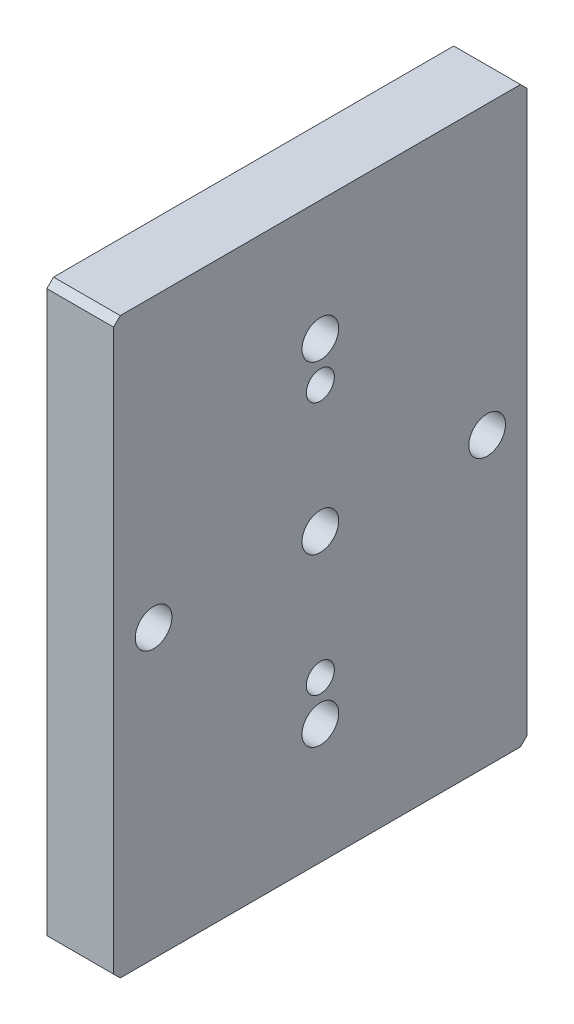
ISO-10303-21;
HEADER;
FILE_DESCRIPTION(('STEP AP214'),'2;1');
FILE_NAME('part.step','',(''),(''),'','','');
FILE_SCHEMA(('AUTOMOTIVE_DESIGN { 1 0 10303 214 1 1 1 1 }'));
ENDSEC;
DATA;
#1=APPLICATION_CONTEXT('core data for automotive mechanical design processes');
#2=APPLICATION_PROTOCOL_DEFINITION('international standard','automotive_design',2000,#1);
#3=PRODUCT_CONTEXT('',#1,'mechanical');
#4=PRODUCT('Part','Part','',(#3));
#5=PRODUCT_RELATED_PRODUCT_CATEGORY('part','',(#4));
#6=PRODUCT_DEFINITION_FORMATION('','',#4);
#7=PRODUCT_DEFINITION_CONTEXT('part definition',#1,'design');
#8=PRODUCT_DEFINITION('design','',#6,#7);
#9=PRODUCT_DEFINITION_SHAPE('','',#8);
#10=(LENGTH_UNIT() NAMED_UNIT(*) SI_UNIT(.MILLI.,.METRE.));
#11=(NAMED_UNIT(*) PLANE_ANGLE_UNIT() SI_UNIT($,.RADIAN.));
#12=(NAMED_UNIT(*) SI_UNIT($,.STERADIAN.) SOLID_ANGLE_UNIT());
#13=UNCERTAINTY_MEASURE_WITH_UNIT(LENGTH_MEASURE(1.E-05),#10,'distance_accuracy_value','');
#14=(GEOMETRIC_REPRESENTATION_CONTEXT(3) GLOBAL_UNCERTAINTY_ASSIGNED_CONTEXT((#13)) GLOBAL_UNIT_ASSIGNED_CONTEXT((#10,
#11,#12)) REPRESENTATION_CONTEXT('',''));
#15=CARTESIAN_POINT('',(0.,0.,0.));
#16=DIRECTION('',(0.,0.,1.));
#17=DIRECTION('',(1.,0.,0.));
#18=AXIS2_PLACEMENT_3D('',#15,#16,#17);
#19=CARTESIAN_POINT('',(0.,0.,0.));
#20=DIRECTION('',(1.,0.,0.));
#21=DIRECTION('',(0.,0.,-1.));
#22=AXIS2_PLACEMENT_3D('',#19,#20,#21);
#23=PLANE('',#22);
#24=DIRECTION('',(0.,-1.,0.));
#25=VECTOR('',#24,1.);
#26=CARTESIAN_POINT('',(0.,-43.,31.));
#27=LINE('',#26,#25);
#28=CARTESIAN_POINT('',(0.,42.,31.));
#29=VERTEX_POINT('',#28);
#30=CARTESIAN_POINT('',(0.,-42.,31.));
#31=VERTEX_POINT('',#30);
#32=EDGE_CURVE('E163',#29,#31,#27,.T.);
#33=ORIENTED_EDGE('',*,*,#32,.F.);
#34=DIRECTION('',(0.,-0.707106781186548,0.707106781186548));
#35=VECTOR('',#34,1.);
#36=CARTESIAN_POINT('',(0.,42.,31.));
#37=LINE('',#36,#35);
#38=CARTESIAN_POINT('',(0.,43.,30.));
#39=VERTEX_POINT('',#38);
#40=EDGE_CURVE('E198',#29,#39,#37,.F.);
#41=ORIENTED_EDGE('',*,*,#40,.T.);
#42=DIRECTION('',(0.,0.,1.));
#43=VECTOR('',#42,1.);
#44=CARTESIAN_POINT('',(0.,43.,-31.));
#45=LINE('',#44,#43);
#46=CARTESIAN_POINT('',(0.,43.,-30.));
#47=VERTEX_POINT('',#46);
#48=EDGE_CURVE('E168',#47,#39,#45,.T.);
#49=ORIENTED_EDGE('',*,*,#48,.F.);
#50=DIRECTION('',(0.,0.707106781186548,0.707106781186548));
#51=VECTOR('',#50,1.);
#52=CARTESIAN_POINT('',(0.,43.,-30.));
#53=LINE('',#52,#51);
#54=CARTESIAN_POINT('',(0.,42.,-31.));
#55=VERTEX_POINT('',#54);
#56=EDGE_CURVE('E196',#47,#55,#53,.F.);
#57=ORIENTED_EDGE('',*,*,#56,.T.);
#58=DIRECTION('',(0.,1.,0.));
#59=VECTOR('',#58,1.);
#60=CARTESIAN_POINT('',(0.,-43.,-31.));
#61=LINE('',#60,#59);
#62=CARTESIAN_POINT('',(0.,-42.,-31.));
#63=VERTEX_POINT('',#62);
#64=EDGE_CURVE('E183',#63,#55,#61,.T.);
#65=ORIENTED_EDGE('',*,*,#64,.F.);
#66=DIRECTION('',(0.,0.707106781186548,-0.707106781186548));
#67=VECTOR('',#66,1.);
#68=CARTESIAN_POINT('',(0.,-42.,-31.));
#69=LINE('',#68,#67);
#70=CARTESIAN_POINT('',(0.,-43.,-30.));
#71=VERTEX_POINT('',#70);
#72=EDGE_CURVE('E194',#63,#71,#69,.F.);
#73=ORIENTED_EDGE('',*,*,#72,.T.);
#74=DIRECTION('',(0.,0.,-1.));
#75=VECTOR('',#74,1.);
#76=CARTESIAN_POINT('',(0.,-43.,-31.));
#77=LINE('',#76,#75);
#78=CARTESIAN_POINT('',(0.,-43.,30.));
#79=VERTEX_POINT('',#78);
#80=EDGE_CURVE('E180',#79,#71,#77,.T.);
#81=ORIENTED_EDGE('',*,*,#80,.F.);
#82=DIRECTION('',(0.,-0.707106781186548,-0.707106781186548));
#83=VECTOR('',#82,1.);
#84=CARTESIAN_POINT('',(0.,-43.,30.));
#85=LINE('',#84,#83);
#86=EDGE_CURVE('E192',#79,#31,#85,.F.);
#87=ORIENTED_EDGE('',*,*,#86,.T.);
#88=EDGE_LOOP('',(#33,#41,#49,#57,#65,#73,#81,#87));
#89=FACE_BOUND('',#88,.T.);
#90=CARTESIAN_POINT('',(0.,0.,0.));
#91=DIRECTION('',(-1.,0.,0.));
#92=DIRECTION('',(0.,0.,1.));
#93=AXIS2_PLACEMENT_3D('',#90,#91,#92);
#94=CIRCLE('',#93,5.);
#95=CARTESIAN_POINT('',(0.,0.,5.));
#96=VERTEX_POINT('',#95);
#97=EDGE_CURVE('E151',#96,#96,#94,.T.);
#98=ORIENTED_EDGE('',*,*,#97,.F.);
#99=EDGE_LOOP('',(#98));
#100=FACE_BOUND('',#99,.T.);
#101=CARTESIAN_POINT('',(0.,1.74574066942157E-13,-25.));
#102=DIRECTION('',(-1.,0.,0.));
#103=DIRECTION('',(0.,0.,1.));
#104=AXIS2_PLACEMENT_3D('',#101,#102,#103);
#105=CIRCLE('',#104,5.);
#106=CARTESIAN_POINT('',(0.,1.74574066942157E-13,-20.));
#107=VERTEX_POINT('',#106);
#108=EDGE_CURVE('E263',#107,#107,#105,.T.);
#109=ORIENTED_EDGE('',*,*,#108,.F.);
#110=EDGE_LOOP('',(#109));
#111=FACE_BOUND('',#110,.T.);
#112=CARTESIAN_POINT('',(0.,-25.,0.));
#113=DIRECTION('',(-1.,0.,0.));
#114=DIRECTION('',(0.,0.,1.));
#115=AXIS2_PLACEMENT_3D('',#112,#113,#114);
#116=CIRCLE('',#115,5.);
#117=CARTESIAN_POINT('',(0.,-20.2841666666666,-1.6616004249585));
#118=VERTEX_POINT('',#117);
#119=CARTESIAN_POINT('',(0.,-20.2841666666667,1.66160042495846));
#120=VERTEX_POINT('',#119);
#121=EDGE_CURVE('E251',#118,#120,#116,.T.);
#122=ORIENTED_EDGE('',*,*,#121,.F.);
#123=CARTESIAN_POINT('',(0.,-19.,0.));
#124=DIRECTION('',(-1.,0.,0.));
#125=DIRECTION('',(0.,0.,1.));
#126=AXIS2_PLACEMENT_3D('',#123,#124,#125);
#127=CIRCLE('',#126,2.1);
#128=EDGE_CURVE('E229',#120,#118,#127,.T.);
#129=ORIENTED_EDGE('',*,*,#128,.F.);
#130=EDGE_LOOP('',(#122,#129));
#131=FACE_BOUND('',#130,.T.);
#132=CARTESIAN_POINT('',(0.,0.,25.));
#133=DIRECTION('',(-1.,0.,0.));
#134=DIRECTION('',(0.,0.,1.));
#135=AXIS2_PLACEMENT_3D('',#132,#133,#134);
#136=CIRCLE('',#135,5.);
#137=CARTESIAN_POINT('',(0.,0.,30.));
#138=VERTEX_POINT('',#137);
#139=EDGE_CURVE('E239',#138,#138,#136,.T.);
#140=ORIENTED_EDGE('',*,*,#139,.F.);
#141=EDGE_LOOP('',(#140));
#142=FACE_BOUND('',#141,.T.);
#143=CARTESIAN_POINT('',(0.,19.,0.));
#144=DIRECTION('',(-1.,0.,0.));
#145=DIRECTION('',(0.,0.,1.));
#146=AXIS2_PLACEMENT_3D('',#143,#144,#145);
#147=CIRCLE('',#146,2.1);
#148=CARTESIAN_POINT('',(0.,20.2841666666667,-1.66160042495843));
#149=VERTEX_POINT('',#148);
#150=CARTESIAN_POINT('',(0.,20.2841666666666,1.66160042495854));
#151=VERTEX_POINT('',#150);
#152=EDGE_CURVE('E124',#149,#151,#147,.T.);
#153=ORIENTED_EDGE('',*,*,#152,.F.);
#154=CARTESIAN_POINT('',(0.,25.,2.61861100413235E-13));
#155=DIRECTION('',(-1.,0.,0.));
#156=DIRECTION('',(0.,0.,1.));
#157=AXIS2_PLACEMENT_3D('',#154,#155,#156);
#158=CIRCLE('',#157,5.);
#159=EDGE_CURVE('E134',#151,#149,#158,.T.);
#160=ORIENTED_EDGE('',*,*,#159,.F.);
#161=EDGE_LOOP('',(#153,#160));
#162=FACE_BOUND('',#161,.T.);
#163=ADVANCED_FACE('F37',(#89,#100,#111,#131,#142,#162),#23,.F.);
#164=CARTESIAN_POINT('',(10.,-43.,31.));
#165=DIRECTION('',(0.,0.,-1.));
#166=DIRECTION('',(-1.,0.,0.));
#167=AXIS2_PLACEMENT_3D('',#164,#165,#166);
#168=PLANE('',#167);
#169=DIRECTION('',(0.,-1.,0.));
#170=VECTOR('',#169,1.);
#171=CARTESIAN_POINT('',(10.,-43.,31.));
#172=LINE('',#171,#170);
#173=CARTESIAN_POINT('',(10.,42.,31.));
#174=VERTEX_POINT('',#173);
#175=CARTESIAN_POINT('',(10.,-42.,31.));
#176=VERTEX_POINT('',#175);
#177=EDGE_CURVE('E164',#174,#176,#172,.T.);
#178=ORIENTED_EDGE('',*,*,#177,.F.);
#179=DIRECTION('',(-1.,0.,0.));
#180=VECTOR('',#179,1.);
#181=CARTESIAN_POINT('',(10.,42.,31.));
#182=LINE('',#181,#180);
#183=EDGE_CURVE('E189',#174,#29,#182,.T.);
#184=ORIENTED_EDGE('',*,*,#183,.T.);
#185=ORIENTED_EDGE('',*,*,#32,.T.);
#186=DIRECTION('',(1.,0.,0.));
#187=VECTOR('',#186,1.);
#188=CARTESIAN_POINT('',(10.,-42.,31.));
#189=LINE('',#188,#187);
#190=EDGE_CURVE('E177',#31,#176,#189,.T.);
#191=ORIENTED_EDGE('',*,*,#190,.T.);
#192=EDGE_LOOP('',(#178,#184,#185,#191));
#193=FACE_BOUND('',#192,.T.);
#194=ADVANCED_FACE('F288',(#193),#168,.F.);
#195=CARTESIAN_POINT('',(10.,-43.,-31.));
#196=DIRECTION('',(0.,1.,0.));
#197=DIRECTION('',(0.,0.,1.));
#198=AXIS2_PLACEMENT_3D('',#195,#196,#197);
#199=PLANE('',#198);
#200=ORIENTED_EDGE('',*,*,#80,.T.);
#201=DIRECTION('',(1.,0.,0.));
#202=VECTOR('',#201,1.);
#203=CARTESIAN_POINT('',(10.,-43.,-30.));
#204=LINE('',#203,#202);
#205=CARTESIAN_POINT('',(10.,-43.,-30.));
#206=VERTEX_POINT('',#205);
#207=EDGE_CURVE('E221',#71,#206,#204,.T.);
#208=ORIENTED_EDGE('',*,*,#207,.T.);
#209=DIRECTION('',(0.,0.,-1.));
#210=VECTOR('',#209,1.);
#211=CARTESIAN_POINT('',(10.,-43.,-31.));
#212=LINE('',#211,#210);
#213=CARTESIAN_POINT('',(10.,-43.,30.));
#214=VERTEX_POINT('',#213);
#215=EDGE_CURVE('E167',#214,#206,#212,.T.);
#216=ORIENTED_EDGE('',*,*,#215,.F.);
#217=DIRECTION('',(-1.,0.,0.));
#218=VECTOR('',#217,1.);
#219=CARTESIAN_POINT('',(10.,-43.,30.));
#220=LINE('',#219,#218);
#221=EDGE_CURVE('E218',#214,#79,#220,.T.);
#222=ORIENTED_EDGE('',*,*,#221,.T.);
#223=EDGE_LOOP('',(#200,#208,#216,#222));
#224=FACE_BOUND('',#223,.T.);
#225=ADVANCED_FACE('F364',(#224),#199,.F.);
#226=CARTESIAN_POINT('',(10.,-43.,-31.));
#227=DIRECTION('',(0.,0.,1.));
#228=DIRECTION('',(1.,0.,0.));
#229=AXIS2_PLACEMENT_3D('',#226,#227,#228);
#230=PLANE('',#229);
#231=ORIENTED_EDGE('',*,*,#64,.T.);
#232=DIRECTION('',(1.,0.,0.));
#233=VECTOR('',#232,1.);
#234=CARTESIAN_POINT('',(10.,42.,-31.));
#235=LINE('',#234,#233);
#236=CARTESIAN_POINT('',(10.,42.,-31.));
#237=VERTEX_POINT('',#236);
#238=EDGE_CURVE('E216',#55,#237,#235,.T.);
#239=ORIENTED_EDGE('',*,*,#238,.T.);
#240=DIRECTION('',(0.,1.,0.));
#241=VECTOR('',#240,1.);
#242=CARTESIAN_POINT('',(10.,-43.,-31.));
#243=LINE('',#242,#241);
#244=CARTESIAN_POINT('',(10.,-42.,-31.));
#245=VERTEX_POINT('',#244);
#246=EDGE_CURVE('E171',#245,#237,#243,.T.);
#247=ORIENTED_EDGE('',*,*,#246,.F.);
#248=DIRECTION('',(-1.,0.,0.));
#249=VECTOR('',#248,1.);
#250=CARTESIAN_POINT('',(10.,-42.,-31.));
#251=LINE('',#250,#249);
#252=EDGE_CURVE('E213',#245,#63,#251,.T.);
#253=ORIENTED_EDGE('',*,*,#252,.T.);
#254=EDGE_LOOP('',(#231,#239,#247,#253));
#255=FACE_BOUND('',#254,.T.);
#256=ADVANCED_FACE('F360',(#255),#230,.F.);
#257=CARTESIAN_POINT('',(10.,43.,-31.));
#258=DIRECTION('',(0.,-1.,0.));
#259=DIRECTION('',(0.,0.,-1.));
#260=AXIS2_PLACEMENT_3D('',#257,#258,#259);
#261=PLANE('',#260);
#262=ORIENTED_EDGE('',*,*,#48,.T.);
#263=DIRECTION('',(1.,0.,0.));
#264=VECTOR('',#263,1.);
#265=CARTESIAN_POINT('',(10.,43.,30.));
#266=LINE('',#265,#264);
#267=CARTESIAN_POINT('',(10.,43.,30.));
#268=VERTEX_POINT('',#267);
#269=EDGE_CURVE('E203',#39,#268,#266,.T.);
#270=ORIENTED_EDGE('',*,*,#269,.T.);
#271=DIRECTION('',(0.,0.,1.));
#272=VECTOR('',#271,1.);
#273=CARTESIAN_POINT('',(10.,43.,-31.));
#274=LINE('',#273,#272);
#275=CARTESIAN_POINT('',(10.,43.,-30.));
#276=VERTEX_POINT('',#275);
#277=EDGE_CURVE('E174',#276,#268,#274,.T.);
#278=ORIENTED_EDGE('',*,*,#277,.F.);
#279=DIRECTION('',(-1.,0.,0.));
#280=VECTOR('',#279,1.);
#281=CARTESIAN_POINT('',(10.,43.,-30.));
#282=LINE('',#281,#280);
#283=EDGE_CURVE('E200',#276,#47,#282,.T.);
#284=ORIENTED_EDGE('',*,*,#283,.T.);
#285=EDGE_LOOP('',(#262,#270,#278,#284));
#286=FACE_BOUND('',#285,.T.);
#287=ADVANCED_FACE('F355',(#286),#261,.F.);
#288=CARTESIAN_POINT('',(10.,0.,0.));
#289=DIRECTION('',(1.,0.,0.));
#290=DIRECTION('',(0.,0.,-1.));
#291=AXIS2_PLACEMENT_3D('',#288,#289,#290);
#292=PLANE('',#291);
#293=CARTESIAN_POINT('',(10.,19.,0.));
#294=DIRECTION('',(-1.,0.,0.));
#295=DIRECTION('',(0.,0.,1.));
#296=AXIS2_PLACEMENT_3D('',#293,#294,#295);
#297=CIRCLE('',#296,2.1);
#298=CARTESIAN_POINT('',(10.,19.,2.1));
#299=VERTEX_POINT('',#298);
#300=EDGE_CURVE('E129',#299,#299,#297,.T.);
#301=ORIENTED_EDGE('',*,*,#300,.T.);
#302=EDGE_LOOP('',(#301));
#303=FACE_BOUND('',#302,.T.);
#304=CARTESIAN_POINT('',(10.,-19.,0.));
#305=DIRECTION('',(-1.,0.,0.));
#306=DIRECTION('',(0.,0.,1.));
#307=AXIS2_PLACEMENT_3D('',#304,#305,#306);
#308=CIRCLE('',#307,2.1);
#309=CARTESIAN_POINT('',(10.,-19.,2.1));
#310=VERTEX_POINT('',#309);
#311=EDGE_CURVE('E231',#310,#310,#308,.T.);
#312=ORIENTED_EDGE('',*,*,#311,.T.);
#313=EDGE_LOOP('',(#312));
#314=FACE_BOUND('',#313,.T.);
#315=CARTESIAN_POINT('',(10.,0.,25.));
#316=DIRECTION('',(-1.,0.,0.));
#317=DIRECTION('',(0.,0.,1.));
#318=AXIS2_PLACEMENT_3D('',#315,#316,#317);
#319=CIRCLE('',#318,2.75);
#320=CARTESIAN_POINT('',(10.,0.,27.75));
#321=VERTEX_POINT('',#320);
#322=EDGE_CURVE('E248',#321,#321,#319,.T.);
#323=ORIENTED_EDGE('',*,*,#322,.T.);
#324=EDGE_LOOP('',(#323));
#325=FACE_BOUND('',#324,.T.);
#326=CARTESIAN_POINT('',(10.,-25.,0.));
#327=DIRECTION('',(-1.,0.,0.));
#328=DIRECTION('',(0.,0.,1.));
#329=AXIS2_PLACEMENT_3D('',#326,#327,#328);
#330=CIRCLE('',#329,2.75);
#331=CARTESIAN_POINT('',(10.,-25.,2.74999999999991));
#332=VERTEX_POINT('',#331);
#333=EDGE_CURVE('E260',#332,#332,#330,.T.);
#334=ORIENTED_EDGE('',*,*,#333,.T.);
#335=EDGE_LOOP('',(#334));
#336=FACE_BOUND('',#335,.T.);
#337=CARTESIAN_POINT('',(10.,1.74574066942157E-13,-25.));
#338=DIRECTION('',(-1.,0.,0.));
#339=DIRECTION('',(0.,0.,1.));
#340=AXIS2_PLACEMENT_3D('',#337,#338,#339);
#341=CIRCLE('',#340,2.75);
#342=CARTESIAN_POINT('',(10.,1.74574066942157E-13,-22.25));
#343=VERTEX_POINT('',#342);
#344=EDGE_CURVE('E137',#343,#343,#341,.T.);
#345=ORIENTED_EDGE('',*,*,#344,.T.);
#346=EDGE_LOOP('',(#345));
#347=FACE_BOUND('',#346,.T.);
#348=CARTESIAN_POINT('',(10.,25.,2.61861100413235E-13));
#349=DIRECTION('',(-1.,0.,0.));
#350=DIRECTION('',(0.,0.,1.));
#351=AXIS2_PLACEMENT_3D('',#348,#349,#350);
#352=CIRCLE('',#351,2.75);
#353=CARTESIAN_POINT('',(10.,25.,2.75000000000026));
#354=VERTEX_POINT('',#353);
#355=EDGE_CURVE('E148',#354,#354,#352,.T.);
#356=ORIENTED_EDGE('',*,*,#355,.T.);
#357=EDGE_LOOP('',(#356));
#358=FACE_BOUND('',#357,.T.);
#359=CARTESIAN_POINT('',(10.,0.,0.));
#360=DIRECTION('',(-1.,0.,0.));
#361=DIRECTION('',(0.,0.,1.));
#362=AXIS2_PLACEMENT_3D('',#359,#360,#361);
#363=CIRCLE('',#362,2.75);
#364=CARTESIAN_POINT('',(10.,0.,2.75));
#365=VERTEX_POINT('',#364);
#366=EDGE_CURVE('E160',#365,#365,#363,.T.);
#367=ORIENTED_EDGE('',*,*,#366,.T.);
#368=EDGE_LOOP('',(#367));
#369=FACE_BOUND('',#368,.T.);
#370=ORIENTED_EDGE('',*,*,#277,.T.);
#371=DIRECTION('',(0.,0.707106781186548,-0.707106781186548));
#372=VECTOR('',#371,1.);
#373=CARTESIAN_POINT('',(10.,36.5,36.5));
#374=LINE('',#373,#372);
#375=EDGE_CURVE('E211',#268,#174,#374,.F.);
#376=ORIENTED_EDGE('',*,*,#375,.T.);
#377=ORIENTED_EDGE('',*,*,#177,.T.);
#378=DIRECTION('',(0.,0.707106781186548,0.707106781186548));
#379=VECTOR('',#378,1.);
#380=CARTESIAN_POINT('',(10.,-36.5,36.5));
#381=LINE('',#380,#379);
#382=EDGE_CURVE('E205',#176,#214,#381,.F.);
#383=ORIENTED_EDGE('',*,*,#382,.T.);
#384=ORIENTED_EDGE('',*,*,#215,.T.);
#385=DIRECTION('',(0.,-0.707106781186548,0.707106781186548));
#386=VECTOR('',#385,1.);
#387=CARTESIAN_POINT('',(10.,-36.5,-36.5));
#388=LINE('',#387,#386);
#389=EDGE_CURVE('E207',#206,#245,#388,.F.);
#390=ORIENTED_EDGE('',*,*,#389,.T.);
#391=ORIENTED_EDGE('',*,*,#246,.T.);
#392=DIRECTION('',(0.,-0.707106781186548,-0.707106781186548));
#393=VECTOR('',#392,1.);
#394=CARTESIAN_POINT('',(10.,36.5,-36.5));
#395=LINE('',#394,#393);
#396=EDGE_CURVE('E209',#237,#276,#395,.F.);
#397=ORIENTED_EDGE('',*,*,#396,.T.);
#398=EDGE_LOOP('',(#370,#376,#377,#383,#384,#390,#391,#397));
#399=FACE_BOUND('',#398,.T.);
#400=ADVANCED_FACE('F352',(#303,#314,#325,#336,#347,#358,#369,#399),#292,.T.);
#401=CARTESIAN_POINT('',(10.,42.,31.));
#402=DIRECTION('',(0.,-0.707106781186547,-0.707106781186547));
#403=DIRECTION('',(-1.,0.,0.));
#404=AXIS2_PLACEMENT_3D('',#401,#402,#403);
#405=PLANE('',#404);
#406=ORIENTED_EDGE('',*,*,#375,.F.);
#407=ORIENTED_EDGE('',*,*,#269,.F.);
#408=ORIENTED_EDGE('',*,*,#40,.F.);
#409=ORIENTED_EDGE('',*,*,#183,.F.);
#410=EDGE_LOOP('',(#406,#407,#408,#409));
#411=FACE_BOUND('',#410,.T.);
#412=ADVANCED_FACE('F354',(#411),#405,.F.);
#413=CARTESIAN_POINT('',(10.,43.,-30.));
#414=DIRECTION('',(0.,-0.707106781186547,0.707106781186547));
#415=DIRECTION('',(-1.,0.,0.));
#416=AXIS2_PLACEMENT_3D('',#413,#414,#415);
#417=PLANE('',#416);
#418=ORIENTED_EDGE('',*,*,#396,.F.);
#419=ORIENTED_EDGE('',*,*,#238,.F.);
#420=ORIENTED_EDGE('',*,*,#56,.F.);
#421=ORIENTED_EDGE('',*,*,#283,.F.);
#422=EDGE_LOOP('',(#418,#419,#420,#421));
#423=FACE_BOUND('',#422,.T.);
#424=ADVANCED_FACE('F374',(#423),#417,.F.);
#425=CARTESIAN_POINT('',(10.,-42.,-31.));
#426=DIRECTION('',(0.,0.707106781186547,0.707106781186547));
#427=DIRECTION('',(-1.,0.,0.));
#428=AXIS2_PLACEMENT_3D('',#425,#426,#427);
#429=PLANE('',#428);
#430=ORIENTED_EDGE('',*,*,#389,.F.);
#431=ORIENTED_EDGE('',*,*,#207,.F.);
#432=ORIENTED_EDGE('',*,*,#72,.F.);
#433=ORIENTED_EDGE('',*,*,#252,.F.);
#434=EDGE_LOOP('',(#430,#431,#432,#433));
#435=FACE_BOUND('',#434,.T.);
#436=ADVANCED_FACE('F377',(#435),#429,.F.);
#437=CARTESIAN_POINT('',(10.,-43.,30.));
#438=DIRECTION('',(0.,0.707106781186547,-0.707106781186547));
#439=DIRECTION('',(-1.,0.,0.));
#440=AXIS2_PLACEMENT_3D('',#437,#438,#439);
#441=PLANE('',#440);
#442=ORIENTED_EDGE('',*,*,#382,.F.);
#443=ORIENTED_EDGE('',*,*,#190,.F.);
#444=ORIENTED_EDGE('',*,*,#86,.F.);
#445=ORIENTED_EDGE('',*,*,#221,.F.);
#446=EDGE_LOOP('',(#442,#443,#444,#445));
#447=FACE_BOUND('',#446,.T.);
#448=ADVANCED_FACE('F39',(#447),#441,.F.);
#449=CARTESIAN_POINT('',(0.,0.,0.));
#450=DIRECTION('',(-1.,0.,0.));
#451=DIRECTION('',(0.,0.,1.));
#452=AXIS2_PLACEMENT_3D('',#449,#450,#451);
#453=CYLINDRICAL_SURFACE('',#452,2.75);
#454=ORIENTED_EDGE('',*,*,#366,.F.);
#455=EDGE_LOOP('',(#454));
#456=FACE_BOUND('',#455,.T.);
#457=CARTESIAN_POINT('',(5.5,0.,0.));
#458=DIRECTION('',(-1.,0.,0.));
#459=DIRECTION('',(0.,0.,1.));
#460=AXIS2_PLACEMENT_3D('',#457,#458,#459);
#461=CIRCLE('',#460,2.75);
#462=CARTESIAN_POINT('',(5.5,0.,2.75));
#463=VERTEX_POINT('',#462);
#464=EDGE_CURVE('E157',#463,#463,#461,.T.);
#465=ORIENTED_EDGE('',*,*,#464,.T.);
#466=EDGE_LOOP('',(#465));
#467=FACE_BOUND('',#466,.T.);
#468=ADVANCED_FACE('F347',(#456,#467),#453,.F.);
#469=CARTESIAN_POINT('',(5.5,2.75,0.));
#470=DIRECTION('',(1.,0.,0.));
#471=DIRECTION('',(0.,0.,-1.));
#472=AXIS2_PLACEMENT_3D('',#469,#470,#471);
#473=PLANE('',#472);
#474=ORIENTED_EDGE('',*,*,#464,.F.);
#475=EDGE_LOOP('',(#474));
#476=FACE_BOUND('',#475,.T.);
#477=CARTESIAN_POINT('',(5.5,0.,0.));
#478=DIRECTION('',(-1.,0.,0.));
#479=DIRECTION('',(0.,0.,1.));
#480=AXIS2_PLACEMENT_3D('',#477,#478,#479);
#481=CIRCLE('',#480,4.99999999999999);
#482=CARTESIAN_POINT('',(5.5,0.,4.99999999999999));
#483=VERTEX_POINT('',#482);
#484=EDGE_CURVE('E154',#483,#483,#481,.T.);
#485=ORIENTED_EDGE('',*,*,#484,.T.);
#486=EDGE_LOOP('',(#485));
#487=FACE_BOUND('',#486,.T.);
#488=ADVANCED_FACE('F343',(#476,#487),#473,.F.);
#489=CARTESIAN_POINT('',(0.,0.,0.));
#490=DIRECTION('',(-1.,0.,0.));
#491=DIRECTION('',(0.,0.,1.));
#492=AXIS2_PLACEMENT_3D('',#489,#490,#491);
#493=CYLINDRICAL_SURFACE('',#492,5.);
#494=ORIENTED_EDGE('',*,*,#484,.F.);
#495=EDGE_LOOP('',(#494));
#496=FACE_BOUND('',#495,.T.);
#497=ORIENTED_EDGE('',*,*,#97,.T.);
#498=EDGE_LOOP('',(#497));
#499=FACE_BOUND('',#498,.T.);
#500=ADVANCED_FACE('F339',(#496,#499),#493,.F.);
#501=CARTESIAN_POINT('',(0.,25.,2.61861100413235E-13));
#502=DIRECTION('',(-1.,0.,0.));
#503=DIRECTION('',(0.,0.,1.));
#504=AXIS2_PLACEMENT_3D('',#501,#502,#503);
#505=CYLINDRICAL_SURFACE('',#504,2.75);
#506=ORIENTED_EDGE('',*,*,#355,.F.);
#507=EDGE_LOOP('',(#506));
#508=FACE_BOUND('',#507,.T.);
#509=CARTESIAN_POINT('',(5.5,25.,2.61861100413235E-13));
#510=DIRECTION('',(-1.,0.,0.));
#511=DIRECTION('',(0.,0.,1.));
#512=AXIS2_PLACEMENT_3D('',#509,#510,#511);
#513=CIRCLE('',#512,2.75);
#514=CARTESIAN_POINT('',(5.5,25.,2.75000000000026));
#515=VERTEX_POINT('',#514);
#516=EDGE_CURVE('E139',#515,#515,#513,.T.);
#517=ORIENTED_EDGE('',*,*,#516,.T.);
#518=EDGE_LOOP('',(#517));
#519=FACE_BOUND('',#518,.T.);
#520=ADVANCED_FACE('F335',(#508,#519),#505,.F.);
#521=CARTESIAN_POINT('',(5.5,27.75,2.61861100413235E-13));
#522=DIRECTION('',(1.,0.,0.));
#523=DIRECTION('',(0.,0.,-1.));
#524=AXIS2_PLACEMENT_3D('',#521,#522,#523);
#525=PLANE('',#524);
#526=ORIENTED_EDGE('',*,*,#516,.F.);
#527=EDGE_LOOP('',(#526));
#528=FACE_BOUND('',#527,.T.);
#529=CARTESIAN_POINT('',(5.5,25.,2.61861100413235E-13));
#530=DIRECTION('',(-1.,0.,0.));
#531=DIRECTION('',(0.,0.,1.));
#532=AXIS2_PLACEMENT_3D('',#529,#530,#531);
#533=CIRCLE('',#532,5.);
#534=CARTESIAN_POINT('',(5.5,20.2841666666666,1.66160042495854));
#535=VERTEX_POINT('',#534);
#536=CARTESIAN_POINT('',(5.5,20.2841666666667,-1.66160042495843));
#537=VERTEX_POINT('',#536);
#538=EDGE_CURVE('E136',#535,#537,#533,.T.);
#539=ORIENTED_EDGE('',*,*,#538,.T.);
#540=CARTESIAN_POINT('',(5.5,19.,0.));
#541=DIRECTION('',(1.,0.,0.));
#542=DIRECTION('',(0.,0.,-1.));
#543=AXIS2_PLACEMENT_3D('',#540,#541,#542);
#544=CIRCLE('',#543,2.1);
#545=EDGE_CURVE('E52',#537,#535,#544,.T.);
#546=ORIENTED_EDGE('',*,*,#545,.T.);
#547=EDGE_LOOP('',(#539,#546));
#548=FACE_BOUND('',#547,.T.);
#549=ADVANCED_FACE('F228',(#528,#548),#525,.F.);
#550=CARTESIAN_POINT('',(0.,25.,2.61861100413235E-13));
#551=DIRECTION('',(-1.,0.,0.));
#552=DIRECTION('',(0.,0.,1.));
#553=AXIS2_PLACEMENT_3D('',#550,#551,#552);
#554=CYLINDRICAL_SURFACE('',#553,5.);
#555=ORIENTED_EDGE('',*,*,#538,.F.);
#556=DIRECTION('',(-1.,0.,0.));
#557=VECTOR('',#556,1.);
#558=CARTESIAN_POINT('',(5.,20.2841666666666,1.66160042495854));
#559=LINE('',#558,#557);
#560=EDGE_CURVE('E11',#535,#151,#559,.T.);
#561=ORIENTED_EDGE('',*,*,#560,.T.);
#562=ORIENTED_EDGE('',*,*,#159,.T.);
#563=DIRECTION('',(-1.,0.,0.));
#564=VECTOR('',#563,1.);
#565=CARTESIAN_POINT('',(5.,20.2841666666667,-1.66160042495843));
#566=LINE('',#565,#564);
#567=EDGE_CURVE('E45',#149,#537,#566,.F.);
#568=ORIENTED_EDGE('',*,*,#567,.T.);
#569=EDGE_LOOP('',(#555,#561,#562,#568));
#570=FACE_BOUND('',#569,.T.);
#571=ADVANCED_FACE('F133',(#570),#554,.F.);
#572=CARTESIAN_POINT('',(0.,1.74574066942157E-13,-25.));
#573=DIRECTION('',(-1.,0.,0.));
#574=DIRECTION('',(0.,0.,1.));
#575=AXIS2_PLACEMENT_3D('',#572,#573,#574);
#576=CYLINDRICAL_SURFACE('',#575,2.75);
#577=ORIENTED_EDGE('',*,*,#344,.F.);
#578=EDGE_LOOP('',(#577));
#579=FACE_BOUND('',#578,.T.);
#580=CARTESIAN_POINT('',(5.5,1.74574066942157E-13,-25.));
#581=DIRECTION('',(-1.,0.,0.));
#582=DIRECTION('',(0.,0.,1.));
#583=AXIS2_PLACEMENT_3D('',#580,#581,#582);
#584=CIRCLE('',#583,2.75);
#585=CARTESIAN_POINT('',(5.5,1.74574066942157E-13,-22.25));
#586=VERTEX_POINT('',#585);
#587=EDGE_CURVE('E142',#586,#586,#584,.T.);
#588=ORIENTED_EDGE('',*,*,#587,.T.);
#589=EDGE_LOOP('',(#588));
#590=FACE_BOUND('',#589,.T.);
#591=ADVANCED_FACE('F271',(#579,#590),#576,.F.);
#592=CARTESIAN_POINT('',(5.5,2.75000000000017,-25.));
#593=DIRECTION('',(1.,0.,0.));
#594=DIRECTION('',(0.,0.,-1.));
#595=AXIS2_PLACEMENT_3D('',#592,#593,#594);
#596=PLANE('',#595);
#597=ORIENTED_EDGE('',*,*,#587,.F.);
#598=EDGE_LOOP('',(#597));
#599=FACE_BOUND('',#598,.T.);
#600=CARTESIAN_POINT('',(5.5,1.74574066942157E-13,-25.));
#601=DIRECTION('',(-1.,0.,0.));
#602=DIRECTION('',(0.,0.,1.));
#603=AXIS2_PLACEMENT_3D('',#600,#601,#602);
#604=CIRCLE('',#603,5.);
#605=CARTESIAN_POINT('',(5.5,1.74574066942157E-13,-20.));
#606=VERTEX_POINT('',#605);
#607=EDGE_CURVE('E266',#606,#606,#604,.T.);
#608=ORIENTED_EDGE('',*,*,#607,.T.);
#609=EDGE_LOOP('',(#608));
#610=FACE_BOUND('',#609,.T.);
#611=ADVANCED_FACE('F273',(#599,#610),#596,.F.);
#612=CARTESIAN_POINT('',(0.,1.74574066942157E-13,-25.));
#613=DIRECTION('',(-1.,0.,0.));
#614=DIRECTION('',(0.,0.,1.));
#615=AXIS2_PLACEMENT_3D('',#612,#613,#614);
#616=CYLINDRICAL_SURFACE('',#615,5.);
#617=ORIENTED_EDGE('',*,*,#607,.F.);
#618=EDGE_LOOP('',(#617));
#619=FACE_BOUND('',#618,.T.);
#620=ORIENTED_EDGE('',*,*,#108,.T.);
#621=EDGE_LOOP('',(#620));
#622=FACE_BOUND('',#621,.T.);
#623=ADVANCED_FACE('F276',(#619,#622),#616,.F.);
#624=CARTESIAN_POINT('',(0.,-25.,0.));
#625=DIRECTION('',(-1.,0.,0.));
#626=DIRECTION('',(0.,0.,1.));
#627=AXIS2_PLACEMENT_3D('',#624,#625,#626);
#628=CYLINDRICAL_SURFACE('',#627,2.75);
#629=ORIENTED_EDGE('',*,*,#333,.F.);
#630=EDGE_LOOP('',(#629));
#631=FACE_BOUND('',#630,.T.);
#632=CARTESIAN_POINT('',(5.5,-25.,0.));
#633=DIRECTION('',(-1.,0.,0.));
#634=DIRECTION('',(0.,0.,1.));
#635=AXIS2_PLACEMENT_3D('',#632,#633,#634);
#636=CIRCLE('',#635,2.75);
#637=CARTESIAN_POINT('',(5.5,-25.,2.74999999999991));
#638=VERTEX_POINT('',#637);
#639=EDGE_CURVE('E257',#638,#638,#636,.T.);
#640=ORIENTED_EDGE('',*,*,#639,.T.);
#641=EDGE_LOOP('',(#640));
#642=FACE_BOUND('',#641,.T.);
#643=ADVANCED_FACE('F282',(#631,#642),#628,.F.);
#644=CARTESIAN_POINT('',(5.5,-22.25,0.));
#645=DIRECTION('',(1.,0.,0.));
#646=DIRECTION('',(0.,0.,-1.));
#647=AXIS2_PLACEMENT_3D('',#644,#645,#646);
#648=PLANE('',#647);
#649=ORIENTED_EDGE('',*,*,#639,.F.);
#650=EDGE_LOOP('',(#649));
#651=FACE_BOUND('',#650,.T.);
#652=CARTESIAN_POINT('',(5.5,-25.,0.));
#653=DIRECTION('',(-1.,0.,0.));
#654=DIRECTION('',(0.,0.,1.));
#655=AXIS2_PLACEMENT_3D('',#652,#653,#654);
#656=CIRCLE('',#655,5.);
#657=CARTESIAN_POINT('',(5.5,-20.2841666666666,-1.6616004249585));
#658=VERTEX_POINT('',#657);
#659=CARTESIAN_POINT('',(5.5,-20.2841666666667,1.66160042495846));
#660=VERTEX_POINT('',#659);
#661=EDGE_CURVE('E254',#658,#660,#656,.T.);
#662=ORIENTED_EDGE('',*,*,#661,.T.);
#663=CARTESIAN_POINT('',(5.5,-19.,0.));
#664=DIRECTION('',(1.,0.,0.));
#665=DIRECTION('',(0.,0.,-1.));
#666=AXIS2_PLACEMENT_3D('',#663,#664,#665);
#667=CIRCLE('',#666,2.1);
#668=EDGE_CURVE('E60',#660,#658,#667,.T.);
#669=ORIENTED_EDGE('',*,*,#668,.T.);
#670=EDGE_LOOP('',(#662,#669));
#671=FACE_BOUND('',#670,.T.);
#672=ADVANCED_FACE('F320',(#651,#671),#648,.F.);
#673=CARTESIAN_POINT('',(0.,-25.,0.));
#674=DIRECTION('',(-1.,0.,0.));
#675=DIRECTION('',(0.,0.,1.));
#676=AXIS2_PLACEMENT_3D('',#673,#674,#675);
#677=CYLINDRICAL_SURFACE('',#676,5.);
#678=ORIENTED_EDGE('',*,*,#661,.F.);
#679=DIRECTION('',(-1.,0.,0.));
#680=VECTOR('',#679,1.);
#681=CARTESIAN_POINT('',(5.,-20.2841666666666,-1.6616004249585));
#682=LINE('',#681,#680);
#683=EDGE_CURVE('E225',#658,#118,#682,.T.);
#684=ORIENTED_EDGE('',*,*,#683,.T.);
#685=ORIENTED_EDGE('',*,*,#121,.T.);
#686=DIRECTION('',(-1.,0.,0.));
#687=VECTOR('',#686,1.);
#688=CARTESIAN_POINT('',(5.,-20.2841666666667,1.66160042495846));
#689=LINE('',#688,#687);
#690=EDGE_CURVE('E223',#120,#660,#689,.F.);
#691=ORIENTED_EDGE('',*,*,#690,.T.);
#692=EDGE_LOOP('',(#678,#684,#685,#691));
#693=FACE_BOUND('',#692,.T.);
#694=ADVANCED_FACE('F316',(#693),#677,.F.);
#695=CARTESIAN_POINT('',(0.,0.,25.));
#696=DIRECTION('',(-1.,0.,0.));
#697=DIRECTION('',(0.,0.,1.));
#698=AXIS2_PLACEMENT_3D('',#695,#696,#697);
#699=CYLINDRICAL_SURFACE('',#698,2.75);
#700=ORIENTED_EDGE('',*,*,#322,.F.);
#701=EDGE_LOOP('',(#700));
#702=FACE_BOUND('',#701,.T.);
#703=CARTESIAN_POINT('',(5.5,0.,25.));
#704=DIRECTION('',(-1.,0.,0.));
#705=DIRECTION('',(0.,0.,1.));
#706=AXIS2_PLACEMENT_3D('',#703,#704,#705);
#707=CIRCLE('',#706,2.75);
#708=CARTESIAN_POINT('',(5.5,0.,27.75));
#709=VERTEX_POINT('',#708);
#710=EDGE_CURVE('E245',#709,#709,#707,.T.);
#711=ORIENTED_EDGE('',*,*,#710,.T.);
#712=EDGE_LOOP('',(#711));
#713=FACE_BOUND('',#712,.T.);
#714=ADVANCED_FACE('F308',(#702,#713),#699,.F.);
#715=CARTESIAN_POINT('',(5.5,2.75,25.));
#716=DIRECTION('',(1.,0.,0.));
#717=DIRECTION('',(0.,0.,-1.));
#718=AXIS2_PLACEMENT_3D('',#715,#716,#717);
#719=PLANE('',#718);
#720=ORIENTED_EDGE('',*,*,#710,.F.);
#721=EDGE_LOOP('',(#720));
#722=FACE_BOUND('',#721,.T.);
#723=CARTESIAN_POINT('',(5.5,0.,25.));
#724=DIRECTION('',(-1.,0.,0.));
#725=DIRECTION('',(0.,0.,1.));
#726=AXIS2_PLACEMENT_3D('',#723,#724,#725);
#727=CIRCLE('',#726,5.);
#728=CARTESIAN_POINT('',(5.5,0.,30.));
#729=VERTEX_POINT('',#728);
#730=EDGE_CURVE('E242',#729,#729,#727,.T.);
#731=ORIENTED_EDGE('',*,*,#730,.T.);
#732=EDGE_LOOP('',(#731));
#733=FACE_BOUND('',#732,.T.);
#734=ADVANCED_FACE('F299',(#722,#733),#719,.F.);
#735=CARTESIAN_POINT('',(0.,0.,25.));
#736=DIRECTION('',(-1.,0.,0.));
#737=DIRECTION('',(0.,0.,1.));
#738=AXIS2_PLACEMENT_3D('',#735,#736,#737);
#739=CYLINDRICAL_SURFACE('',#738,5.);
#740=ORIENTED_EDGE('',*,*,#730,.F.);
#741=EDGE_LOOP('',(#740));
#742=FACE_BOUND('',#741,.T.);
#743=ORIENTED_EDGE('',*,*,#139,.T.);
#744=EDGE_LOOP('',(#743));
#745=FACE_BOUND('',#744,.T.);
#746=ADVANCED_FACE('F296',(#742,#745),#739,.F.);
#747=CARTESIAN_POINT('',(0.,-19.,0.));
#748=DIRECTION('',(-1.,0.,0.));
#749=DIRECTION('',(0.,0.,1.));
#750=AXIS2_PLACEMENT_3D('',#747,#748,#749);
#751=CYLINDRICAL_SURFACE('',#750,2.1);
#752=ORIENTED_EDGE('',*,*,#311,.F.);
#753=EDGE_LOOP('',(#752));
#754=FACE_BOUND('',#753,.T.);
#755=ORIENTED_EDGE('',*,*,#668,.F.);
#756=ORIENTED_EDGE('',*,*,#690,.F.);
#757=ORIENTED_EDGE('',*,*,#128,.T.);
#758=ORIENTED_EDGE('',*,*,#683,.F.);
#759=EDGE_LOOP('',(#755,#756,#757,#758));
#760=FACE_BOUND('',#759,.T.);
#761=ADVANCED_FACE('F298',(#754,#760),#751,.F.);
#762=CARTESIAN_POINT('',(0.,19.,0.));
#763=DIRECTION('',(-1.,0.,0.));
#764=DIRECTION('',(0.,0.,1.));
#765=AXIS2_PLACEMENT_3D('',#762,#763,#764);
#766=CYLINDRICAL_SURFACE('',#765,2.1);
#767=ORIENTED_EDGE('',*,*,#300,.F.);
#768=EDGE_LOOP('',(#767));
#769=FACE_BOUND('',#768,.T.);
#770=ORIENTED_EDGE('',*,*,#545,.F.);
#771=ORIENTED_EDGE('',*,*,#567,.F.);
#772=ORIENTED_EDGE('',*,*,#152,.T.);
#773=ORIENTED_EDGE('',*,*,#560,.F.);
#774=EDGE_LOOP('',(#770,#771,#772,#773));
#775=FACE_BOUND('',#774,.T.);
#776=ADVANCED_FACE('F125',(#769,#775),#766,.F.);
#777=CLOSED_SHELL('',(#163,#194,#225,#256,#287,#400,#412,#424,#436,#448,#468,#488,#500,#520,
#549,#571,#591,#611,#623,#643,#672,#694,#714,#734,#746,#761,#776));
#778=MANIFOLD_SOLID_BREP('B2',#777);
#779=ADVANCED_BREP_SHAPE_REPRESENTATION('',(#18,#778),#14);
#780=SHAPE_DEFINITION_REPRESENTATION(#9,#779);
ENDSEC;
END-ISO-10303-21;
